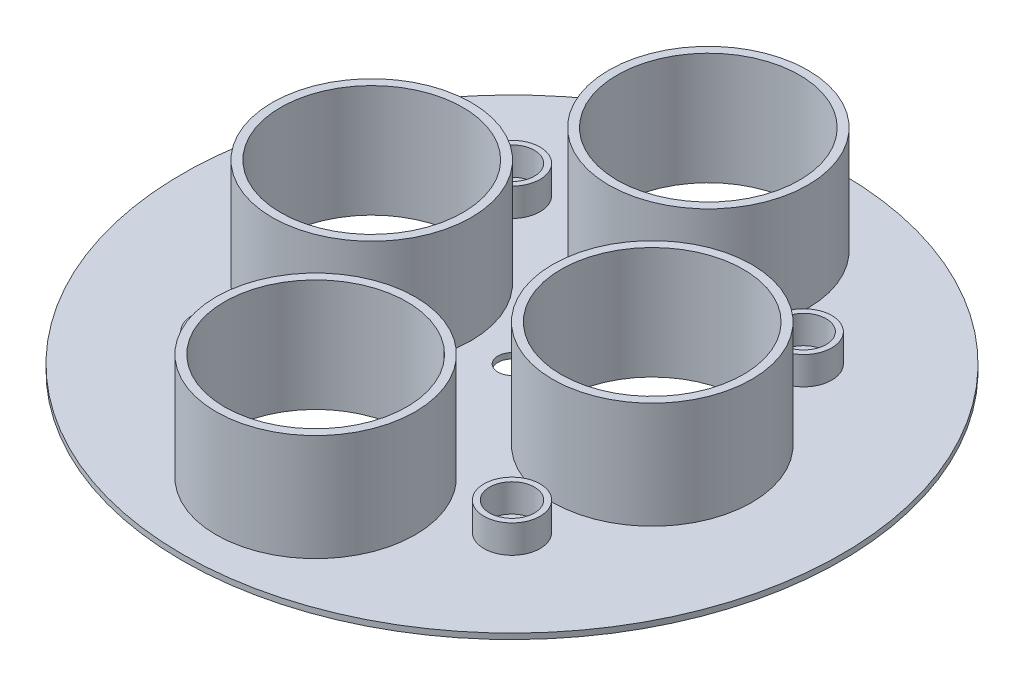
ISO-10303-21;
HEADER;
FILE_DESCRIPTION(('STEP AP214'),'2;1');
FILE_NAME('part.step','',(''),(''),'','','');
FILE_SCHEMA(('AUTOMOTIVE_DESIGN { 1 0 10303 214 1 1 1 1 }'));
ENDSEC;
DATA;
#1=APPLICATION_CONTEXT('core data for automotive mechanical design processes');
#2=APPLICATION_PROTOCOL_DEFINITION('international standard','automotive_design',2000,#1);
#3=PRODUCT_CONTEXT('',#1,'mechanical');
#4=PRODUCT('Part','Part','',(#3));
#5=PRODUCT_RELATED_PRODUCT_CATEGORY('part','',(#4));
#6=PRODUCT_DEFINITION_FORMATION('','',#4);
#7=PRODUCT_DEFINITION_CONTEXT('part definition',#1,'design');
#8=PRODUCT_DEFINITION('design','',#6,#7);
#9=PRODUCT_DEFINITION_SHAPE('','',#8);
#10=(LENGTH_UNIT() NAMED_UNIT(*) SI_UNIT(.MILLI.,.METRE.));
#11=(NAMED_UNIT(*) PLANE_ANGLE_UNIT() SI_UNIT($,.RADIAN.));
#12=(NAMED_UNIT(*) SI_UNIT($,.STERADIAN.) SOLID_ANGLE_UNIT());
#13=UNCERTAINTY_MEASURE_WITH_UNIT(LENGTH_MEASURE(1.E-05),#10,'distance_accuracy_value','');
#14=(GEOMETRIC_REPRESENTATION_CONTEXT(3) GLOBAL_UNCERTAINTY_ASSIGNED_CONTEXT((#13)) GLOBAL_UNIT_ASSIGNED_CONTEXT((#10,
#11,#12)) REPRESENTATION_CONTEXT('',''));
#15=CARTESIAN_POINT('',(0.,0.,0.));
#16=DIRECTION('',(0.,0.,1.));
#17=DIRECTION('',(1.,0.,0.));
#18=AXIS2_PLACEMENT_3D('',#15,#16,#17);
#19=CARTESIAN_POINT('',(0.,2.,0.));
#20=DIRECTION('',(0.,1.,0.));
#21=DIRECTION('',(0.,0.,1.));
#22=AXIS2_PLACEMENT_3D('',#19,#20,#21);
#23=PLANE('',#22);
#24=CARTESIAN_POINT('',(52.,2.,-52.));
#25=DIRECTION('',(0.,1.,0.));
#26=DIRECTION('',(1.,0.,0.));
#27=AXIS2_PLACEMENT_3D('',#24,#25,#26);
#28=CIRCLE('',#27,10.);
#29=CARTESIAN_POINT('',(62.,2.,-52.));
#30=VERTEX_POINT('',#29);
#31=EDGE_CURVE('E210',#30,#30,#28,.T.);
#32=ORIENTED_EDGE('',*,*,#31,.F.);
#33=EDGE_LOOP('',(#32));
#34=FACE_BOUND('',#33,.T.);
#35=CARTESIAN_POINT('',(-52.,2.,-52.));
#36=DIRECTION('',(0.,1.,0.));
#37=DIRECTION('',(1.,0.,0.));
#38=AXIS2_PLACEMENT_3D('',#35,#36,#37);
#39=CIRCLE('',#38,10.);
#40=CARTESIAN_POINT('',(-42.,2.,-52.));
#41=VERTEX_POINT('',#40);
#42=EDGE_CURVE('E201',#41,#41,#39,.T.);
#43=ORIENTED_EDGE('',*,*,#42,.F.);
#44=EDGE_LOOP('',(#43));
#45=FACE_BOUND('',#44,.T.);
#46=CARTESIAN_POINT('',(-52.,2.,52.));
#47=DIRECTION('',(0.,1.,0.));
#48=DIRECTION('',(1.,0.,0.));
#49=AXIS2_PLACEMENT_3D('',#46,#47,#48);
#50=CIRCLE('',#49,10.);
#51=CARTESIAN_POINT('',(-42.,2.,52.));
#52=VERTEX_POINT('',#51);
#53=EDGE_CURVE('E192',#52,#52,#50,.T.);
#54=ORIENTED_EDGE('',*,*,#53,.F.);
#55=EDGE_LOOP('',(#54));
#56=FACE_BOUND('',#55,.T.);
#57=CARTESIAN_POINT('',(52.,2.,52.));
#58=DIRECTION('',(0.,1.,0.));
#59=DIRECTION('',(1.,0.,0.));
#60=AXIS2_PLACEMENT_3D('',#57,#58,#59);
#61=CIRCLE('',#60,10.);
#62=CARTESIAN_POINT('',(62.,2.,52.));
#63=VERTEX_POINT('',#62);
#64=EDGE_CURVE('E183',#63,#63,#61,.T.);
#65=ORIENTED_EDGE('',*,*,#64,.F.);
#66=EDGE_LOOP('',(#65));
#67=FACE_BOUND('',#66,.T.);
#68=CARTESIAN_POINT('',(50.,2.,0.));
#69=DIRECTION('',(0.,1.,0.));
#70=DIRECTION('',(0.,0.,1.));
#71=AXIS2_PLACEMENT_3D('',#68,#69,#70);
#72=CIRCLE('',#71,35.5);
#73=CARTESIAN_POINT('',(50.,2.,35.5));
#74=VERTEX_POINT('',#73);
#75=EDGE_CURVE('E164',#74,#74,#72,.F.);
#76=ORIENTED_EDGE('',*,*,#75,.T.);
#77=EDGE_LOOP('',(#76));
#78=FACE_BOUND('',#77,.T.);
#79=CARTESIAN_POINT('',(0.,2.,70.));
#80=DIRECTION('',(0.,1.,0.));
#81=DIRECTION('',(0.,0.,1.));
#82=AXIS2_PLACEMENT_3D('',#79,#80,#81);
#83=CIRCLE('',#82,35.5);
#84=CARTESIAN_POINT('',(0.,2.,105.5));
#85=VERTEX_POINT('',#84);
#86=EDGE_CURVE('E144',#85,#85,#83,.F.);
#87=ORIENTED_EDGE('',*,*,#86,.T.);
#88=EDGE_LOOP('',(#87));
#89=FACE_BOUND('',#88,.T.);
#90=CARTESIAN_POINT('',(0.,2.,0.));
#91=DIRECTION('',(0.,1.,0.));
#92=DIRECTION('',(0.,0.,1.));
#93=AXIS2_PLACEMENT_3D('',#90,#91,#92);
#94=CIRCLE('',#93,117.5);
#95=CARTESIAN_POINT('',(0.,2.,117.5));
#96=VERTEX_POINT('',#95);
#97=EDGE_CURVE('E122',#96,#96,#94,.T.);
#98=ORIENTED_EDGE('',*,*,#97,.T.);
#99=EDGE_LOOP('',(#98));
#100=FACE_BOUND('',#99,.T.);
#101=CARTESIAN_POINT('',(0.,2.,0.));
#102=DIRECTION('',(0.,1.,0.));
#103=DIRECTION('',(0.,0.,1.));
#104=AXIS2_PLACEMENT_3D('',#101,#102,#103);
#105=CIRCLE('',#104,5.);
#106=CARTESIAN_POINT('',(0.,2.,5.));
#107=VERTEX_POINT('',#106);
#108=EDGE_CURVE('E140',#107,#107,#105,.T.);
#109=ORIENTED_EDGE('',*,*,#108,.F.);
#110=EDGE_LOOP('',(#109));
#111=FACE_BOUND('',#110,.T.);
#112=CARTESIAN_POINT('',(-50.,2.,0.));
#113=DIRECTION('',(0.,1.,0.));
#114=DIRECTION('',(0.,0.,1.));
#115=AXIS2_PLACEMENT_3D('',#112,#113,#114);
#116=CIRCLE('',#115,35.5);
#117=CARTESIAN_POINT('',(-50.,2.,35.5));
#118=VERTEX_POINT('',#117);
#119=EDGE_CURVE('E155',#118,#118,#116,.F.);
#120=ORIENTED_EDGE('',*,*,#119,.T.);
#121=EDGE_LOOP('',(#120));
#122=FACE_BOUND('',#121,.T.);
#123=CARTESIAN_POINT('',(0.,2.,-70.));
#124=DIRECTION('',(0.,1.,0.));
#125=DIRECTION('',(0.,0.,1.));
#126=AXIS2_PLACEMENT_3D('',#123,#124,#125);
#127=CIRCLE('',#126,35.5);
#128=CARTESIAN_POINT('',(0.,2.,-34.5));
#129=VERTEX_POINT('',#128);
#130=EDGE_CURVE('E173',#129,#129,#127,.F.);
#131=ORIENTED_EDGE('',*,*,#130,.T.);
#132=EDGE_LOOP('',(#131));
#133=FACE_BOUND('',#132,.T.);
#134=ADVANCED_FACE('F102',(#34,#45,#56,#67,#78,#89,#100,#111,#122,#133),#23,.T.);
#135=CARTESIAN_POINT('',(0.,0.,0.));
#136=DIRECTION('',(0.,1.,0.));
#137=DIRECTION('',(0.,0.,1.));
#138=AXIS2_PLACEMENT_3D('',#135,#136,#137);
#139=PLANE('',#138);
#140=CARTESIAN_POINT('',(0.,0.,-70.));
#141=DIRECTION('',(0.,1.,0.));
#142=DIRECTION('',(0.,0.,1.));
#143=AXIS2_PLACEMENT_3D('',#140,#141,#142);
#144=CIRCLE('',#143,32.5);
#145=CARTESIAN_POINT('',(0.,0.,-37.5));
#146=VERTEX_POINT('',#145);
#147=EDGE_CURVE('E126',#146,#146,#144,.T.);
#148=ORIENTED_EDGE('',*,*,#147,.T.);
#149=EDGE_LOOP('',(#148));
#150=FACE_BOUND('',#149,.T.);
#151=CARTESIAN_POINT('',(-50.,0.,0.));
#152=DIRECTION('',(0.,1.,0.));
#153=DIRECTION('',(0.,0.,1.));
#154=AXIS2_PLACEMENT_3D('',#151,#152,#153);
#155=CIRCLE('',#154,32.5);
#156=CARTESIAN_POINT('',(-50.,0.,32.5));
#157=VERTEX_POINT('',#156);
#158=EDGE_CURVE('E137',#157,#157,#155,.T.);
#159=ORIENTED_EDGE('',*,*,#158,.T.);
#160=EDGE_LOOP('',(#159));
#161=FACE_BOUND('',#160,.T.);
#162=CARTESIAN_POINT('',(0.,0.,0.));
#163=DIRECTION('',(0.,1.,0.));
#164=DIRECTION('',(0.,0.,1.));
#165=AXIS2_PLACEMENT_3D('',#162,#163,#164);
#166=CIRCLE('',#165,117.5);
#167=CARTESIAN_POINT('',(0.,0.,117.5));
#168=VERTEX_POINT('',#167);
#169=EDGE_CURVE('E123',#168,#168,#166,.T.);
#170=ORIENTED_EDGE('',*,*,#169,.F.);
#171=EDGE_LOOP('',(#170));
#172=FACE_BOUND('',#171,.T.);
#173=CARTESIAN_POINT('',(0.,0.,0.));
#174=DIRECTION('',(0.,1.,0.));
#175=DIRECTION('',(0.,0.,1.));
#176=AXIS2_PLACEMENT_3D('',#173,#174,#175);
#177=CIRCLE('',#176,5.);
#178=CARTESIAN_POINT('',(0.,0.,5.));
#179=VERTEX_POINT('',#178);
#180=EDGE_CURVE('E141',#179,#179,#177,.T.);
#181=ORIENTED_EDGE('',*,*,#180,.T.);
#182=EDGE_LOOP('',(#181));
#183=FACE_BOUND('',#182,.T.);
#184=CARTESIAN_POINT('',(0.,0.,70.));
#185=DIRECTION('',(0.,1.,0.));
#186=DIRECTION('',(0.,0.,1.));
#187=AXIS2_PLACEMENT_3D('',#184,#185,#186);
#188=CIRCLE('',#187,32.5);
#189=CARTESIAN_POINT('',(0.,0.,102.5));
#190=VERTEX_POINT('',#189);
#191=EDGE_CURVE('E134',#190,#190,#188,.T.);
#192=ORIENTED_EDGE('',*,*,#191,.T.);
#193=EDGE_LOOP('',(#192));
#194=FACE_BOUND('',#193,.T.);
#195=CARTESIAN_POINT('',(50.,0.,0.));
#196=DIRECTION('',(0.,1.,0.));
#197=DIRECTION('',(0.,0.,1.));
#198=AXIS2_PLACEMENT_3D('',#195,#196,#197);
#199=CIRCLE('',#198,32.5);
#200=CARTESIAN_POINT('',(50.,0.,32.5));
#201=VERTEX_POINT('',#200);
#202=EDGE_CURVE('E131',#201,#201,#199,.T.);
#203=ORIENTED_EDGE('',*,*,#202,.T.);
#204=EDGE_LOOP('',(#203));
#205=FACE_BOUND('',#204,.T.);
#206=ADVANCED_FACE('F240',(#150,#161,#172,#183,#194,#205),#139,.F.);
#207=CARTESIAN_POINT('',(0.,2.,0.));
#208=DIRECTION('',(0.,-1.,0.));
#209=DIRECTION('',(0.,0.,-1.));
#210=AXIS2_PLACEMENT_3D('',#207,#208,#209);
#211=CYLINDRICAL_SURFACE('',#210,117.5);
#212=ORIENTED_EDGE('',*,*,#97,.F.);
#213=EDGE_LOOP('',(#212));
#214=FACE_BOUND('',#213,.T.);
#215=ORIENTED_EDGE('',*,*,#169,.T.);
#216=EDGE_LOOP('',(#215));
#217=FACE_BOUND('',#216,.T.);
#218=ADVANCED_FACE('F104',(#214,#217),#211,.T.);
#219=CARTESIAN_POINT('',(0.,2.,-70.));
#220=DIRECTION('',(0.,-1.,0.));
#221=DIRECTION('',(0.,0.,-1.));
#222=AXIS2_PLACEMENT_3D('',#219,#220,#221);
#223=CYLINDRICAL_SURFACE('',#222,32.5);
#224=ORIENTED_EDGE('',*,*,#147,.F.);
#225=EDGE_LOOP('',(#224));
#226=FACE_BOUND('',#225,.T.);
#227=CARTESIAN_POINT('',(0.,40.,-70.));
#228=DIRECTION('',(0.,1.,0.));
#229=DIRECTION('',(0.,0.,1.));
#230=AXIS2_PLACEMENT_3D('',#227,#228,#229);
#231=CIRCLE('',#230,32.5);
#232=CARTESIAN_POINT('',(0.,40.,-37.5));
#233=VERTEX_POINT('',#232);
#234=EDGE_CURVE('E179',#233,#233,#231,.T.);
#235=ORIENTED_EDGE('',*,*,#234,.T.);
#236=EDGE_LOOP('',(#235));
#237=FACE_BOUND('',#236,.T.);
#238=ADVANCED_FACE('F342',(#226,#237),#223,.F.);
#239=CARTESIAN_POINT('',(50.,2.,0.));
#240=DIRECTION('',(0.,-1.,0.));
#241=DIRECTION('',(0.,0.,-1.));
#242=AXIS2_PLACEMENT_3D('',#239,#240,#241);
#243=CYLINDRICAL_SURFACE('',#242,32.5);
#244=ORIENTED_EDGE('',*,*,#202,.F.);
#245=EDGE_LOOP('',(#244));
#246=FACE_BOUND('',#245,.T.);
#247=CARTESIAN_POINT('',(50.,40.,0.));
#248=DIRECTION('',(0.,1.,0.));
#249=DIRECTION('',(0.,0.,1.));
#250=AXIS2_PLACEMENT_3D('',#247,#248,#249);
#251=CIRCLE('',#250,32.5);
#252=CARTESIAN_POINT('',(50.,40.,32.5));
#253=VERTEX_POINT('',#252);
#254=EDGE_CURVE('E170',#253,#253,#251,.T.);
#255=ORIENTED_EDGE('',*,*,#254,.T.);
#256=EDGE_LOOP('',(#255));
#257=FACE_BOUND('',#256,.T.);
#258=ADVANCED_FACE('F339',(#246,#257),#243,.F.);
#259=CARTESIAN_POINT('',(0.,2.,70.));
#260=DIRECTION('',(0.,-1.,0.));
#261=DIRECTION('',(0.,0.,-1.));
#262=AXIS2_PLACEMENT_3D('',#259,#260,#261);
#263=CYLINDRICAL_SURFACE('',#262,32.5);
#264=ORIENTED_EDGE('',*,*,#191,.F.);
#265=EDGE_LOOP('',(#264));
#266=FACE_BOUND('',#265,.T.);
#267=CARTESIAN_POINT('',(0.,40.,70.));
#268=DIRECTION('',(0.,1.,0.));
#269=DIRECTION('',(0.,0.,1.));
#270=AXIS2_PLACEMENT_3D('',#267,#268,#269);
#271=CIRCLE('',#270,32.5);
#272=CARTESIAN_POINT('',(0.,40.,102.5));
#273=VERTEX_POINT('',#272);
#274=EDGE_CURVE('E152',#273,#273,#271,.T.);
#275=ORIENTED_EDGE('',*,*,#274,.T.);
#276=EDGE_LOOP('',(#275));
#277=FACE_BOUND('',#276,.T.);
#278=ADVANCED_FACE('F335',(#266,#277),#263,.F.);
#279=CARTESIAN_POINT('',(-50.,2.,0.));
#280=DIRECTION('',(0.,-1.,0.));
#281=DIRECTION('',(0.,0.,-1.));
#282=AXIS2_PLACEMENT_3D('',#279,#280,#281);
#283=CYLINDRICAL_SURFACE('',#282,32.5);
#284=ORIENTED_EDGE('',*,*,#158,.F.);
#285=EDGE_LOOP('',(#284));
#286=FACE_BOUND('',#285,.T.);
#287=CARTESIAN_POINT('',(-50.,40.,0.));
#288=DIRECTION('',(0.,1.,0.));
#289=DIRECTION('',(0.,0.,1.));
#290=AXIS2_PLACEMENT_3D('',#287,#288,#289);
#291=CIRCLE('',#290,32.5);
#292=CARTESIAN_POINT('',(-50.,40.,32.5));
#293=VERTEX_POINT('',#292);
#294=EDGE_CURVE('E161',#293,#293,#291,.T.);
#295=ORIENTED_EDGE('',*,*,#294,.T.);
#296=EDGE_LOOP('',(#295));
#297=FACE_BOUND('',#296,.T.);
#298=ADVANCED_FACE('F331',(#286,#297),#283,.F.);
#299=CARTESIAN_POINT('',(0.,2.,0.));
#300=DIRECTION('',(0.,-1.,0.));
#301=DIRECTION('',(0.,0.,-1.));
#302=AXIS2_PLACEMENT_3D('',#299,#300,#301);
#303=CYLINDRICAL_SURFACE('',#302,5.);
#304=ORIENTED_EDGE('',*,*,#108,.T.);
#305=EDGE_LOOP('',(#304));
#306=FACE_BOUND('',#305,.T.);
#307=ORIENTED_EDGE('',*,*,#180,.F.);
#308=EDGE_LOOP('',(#307));
#309=FACE_BOUND('',#308,.T.);
#310=ADVANCED_FACE('F324',(#306,#309),#303,.F.);
#311=CARTESIAN_POINT('',(0.,40.,70.));
#312=DIRECTION('',(0.,1.,0.));
#313=DIRECTION('',(0.,0.,1.));
#314=AXIS2_PLACEMENT_3D('',#311,#312,#313);
#315=PLANE('',#314);
#316=CARTESIAN_POINT('',(0.,40.,70.));
#317=DIRECTION('',(0.,1.,0.));
#318=DIRECTION('',(1.,0.,0.));
#319=AXIS2_PLACEMENT_3D('',#316,#317,#318);
#320=CIRCLE('',#319,35.5);
#321=CARTESIAN_POINT('',(35.5,40.,70.));
#322=VERTEX_POINT('',#321);
#323=EDGE_CURVE('E149',#322,#322,#320,.T.);
#324=ORIENTED_EDGE('',*,*,#323,.T.);
#325=EDGE_LOOP('',(#324));
#326=FACE_BOUND('',#325,.T.);
#327=ORIENTED_EDGE('',*,*,#274,.F.);
#328=EDGE_LOOP('',(#327));
#329=FACE_BOUND('',#328,.T.);
#330=ADVANCED_FACE('F321',(#326,#329),#315,.T.);
#331=CARTESIAN_POINT('',(0.,40.,70.));
#332=DIRECTION('',(0.,-1.,0.));
#333=DIRECTION('',(0.,0.,-1.));
#334=AXIS2_PLACEMENT_3D('',#331,#332,#333);
#335=CYLINDRICAL_SURFACE('',#334,35.5);
#336=ORIENTED_EDGE('',*,*,#86,.F.);
#337=EDGE_LOOP('',(#336));
#338=FACE_BOUND('',#337,.T.);
#339=ORIENTED_EDGE('',*,*,#323,.F.);
#340=EDGE_LOOP('',(#339));
#341=FACE_BOUND('',#340,.T.);
#342=ADVANCED_FACE('F316',(#338,#341),#335,.T.);
#343=CARTESIAN_POINT('',(-50.,40.,0.));
#344=DIRECTION('',(0.,1.,0.));
#345=DIRECTION('',(0.,0.,1.));
#346=AXIS2_PLACEMENT_3D('',#343,#344,#345);
#347=PLANE('',#346);
#348=CARTESIAN_POINT('',(-50.,40.,0.));
#349=DIRECTION('',(0.,1.,0.));
#350=DIRECTION('',(1.,0.,0.));
#351=AXIS2_PLACEMENT_3D('',#348,#349,#350);
#352=CIRCLE('',#351,35.5);
#353=CARTESIAN_POINT('',(-14.5,40.,0.));
#354=VERTEX_POINT('',#353);
#355=EDGE_CURVE('E158',#354,#354,#352,.T.);
#356=ORIENTED_EDGE('',*,*,#355,.T.);
#357=EDGE_LOOP('',(#356));
#358=FACE_BOUND('',#357,.T.);
#359=ORIENTED_EDGE('',*,*,#294,.F.);
#360=EDGE_LOOP('',(#359));
#361=FACE_BOUND('',#360,.T.);
#362=ADVANCED_FACE('F313',(#358,#361),#347,.T.);
#363=CARTESIAN_POINT('',(-50.,40.,0.));
#364=DIRECTION('',(0.,-1.,0.));
#365=DIRECTION('',(0.,0.,-1.));
#366=AXIS2_PLACEMENT_3D('',#363,#364,#365);
#367=CYLINDRICAL_SURFACE('',#366,35.5);
#368=ORIENTED_EDGE('',*,*,#119,.F.);
#369=EDGE_LOOP('',(#368));
#370=FACE_BOUND('',#369,.T.);
#371=ORIENTED_EDGE('',*,*,#355,.F.);
#372=EDGE_LOOP('',(#371));
#373=FACE_BOUND('',#372,.T.);
#374=ADVANCED_FACE('F308',(#370,#373),#367,.T.);
#375=CARTESIAN_POINT('',(50.,40.,0.));
#376=DIRECTION('',(0.,1.,0.));
#377=DIRECTION('',(0.,0.,1.));
#378=AXIS2_PLACEMENT_3D('',#375,#376,#377);
#379=PLANE('',#378);
#380=CARTESIAN_POINT('',(50.,40.,0.));
#381=DIRECTION('',(0.,1.,0.));
#382=DIRECTION('',(1.,0.,0.));
#383=AXIS2_PLACEMENT_3D('',#380,#381,#382);
#384=CIRCLE('',#383,35.5);
#385=CARTESIAN_POINT('',(85.5,40.,0.));
#386=VERTEX_POINT('',#385);
#387=EDGE_CURVE('E167',#386,#386,#384,.T.);
#388=ORIENTED_EDGE('',*,*,#387,.T.);
#389=EDGE_LOOP('',(#388));
#390=FACE_BOUND('',#389,.T.);
#391=ORIENTED_EDGE('',*,*,#254,.F.);
#392=EDGE_LOOP('',(#391));
#393=FACE_BOUND('',#392,.T.);
#394=ADVANCED_FACE('F305',(#390,#393),#379,.T.);
#395=CARTESIAN_POINT('',(50.,40.,0.));
#396=DIRECTION('',(0.,-1.,0.));
#397=DIRECTION('',(0.,0.,-1.));
#398=AXIS2_PLACEMENT_3D('',#395,#396,#397);
#399=CYLINDRICAL_SURFACE('',#398,35.5);
#400=ORIENTED_EDGE('',*,*,#75,.F.);
#401=EDGE_LOOP('',(#400));
#402=FACE_BOUND('',#401,.T.);
#403=ORIENTED_EDGE('',*,*,#387,.F.);
#404=EDGE_LOOP('',(#403));
#405=FACE_BOUND('',#404,.T.);
#406=ADVANCED_FACE('F300',(#402,#405),#399,.T.);
#407=CARTESIAN_POINT('',(0.,40.,-70.));
#408=DIRECTION('',(0.,1.,0.));
#409=DIRECTION('',(0.,0.,1.));
#410=AXIS2_PLACEMENT_3D('',#407,#408,#409);
#411=PLANE('',#410);
#412=CARTESIAN_POINT('',(0.,40.,-70.));
#413=DIRECTION('',(0.,1.,0.));
#414=DIRECTION('',(1.,0.,0.));
#415=AXIS2_PLACEMENT_3D('',#412,#413,#414);
#416=CIRCLE('',#415,35.5);
#417=CARTESIAN_POINT('',(35.5,40.,-70.));
#418=VERTEX_POINT('',#417);
#419=EDGE_CURVE('E176',#418,#418,#416,.T.);
#420=ORIENTED_EDGE('',*,*,#419,.T.);
#421=EDGE_LOOP('',(#420));
#422=FACE_BOUND('',#421,.T.);
#423=ORIENTED_EDGE('',*,*,#234,.F.);
#424=EDGE_LOOP('',(#423));
#425=FACE_BOUND('',#424,.T.);
#426=ADVANCED_FACE('F297',(#422,#425),#411,.T.);
#427=CARTESIAN_POINT('',(0.,40.,-70.));
#428=DIRECTION('',(0.,-1.,0.));
#429=DIRECTION('',(0.,0.,-1.));
#430=AXIS2_PLACEMENT_3D('',#427,#428,#429);
#431=CYLINDRICAL_SURFACE('',#430,35.5);
#432=ORIENTED_EDGE('',*,*,#130,.F.);
#433=EDGE_LOOP('',(#432));
#434=FACE_BOUND('',#433,.T.);
#435=ORIENTED_EDGE('',*,*,#419,.F.);
#436=EDGE_LOOP('',(#435));
#437=FACE_BOUND('',#436,.T.);
#438=ADVANCED_FACE('F292',(#434,#437),#431,.T.);
#439=CARTESIAN_POINT('',(52.,12.,52.));
#440=DIRECTION('',(0.,1.,0.));
#441=DIRECTION('',(0.,0.,1.));
#442=AXIS2_PLACEMENT_3D('',#439,#440,#441);
#443=PLANE('',#442);
#444=CARTESIAN_POINT('',(52.,12.,52.));
#445=DIRECTION('',(0.,1.,0.));
#446=DIRECTION('',(1.,0.,0.));
#447=AXIS2_PLACEMENT_3D('',#444,#445,#446);
#448=CIRCLE('',#447,10.);
#449=CARTESIAN_POINT('',(62.,12.,52.));
#450=VERTEX_POINT('',#449);
#451=EDGE_CURVE('E182',#450,#450,#448,.T.);
#452=ORIENTED_EDGE('',*,*,#451,.T.);
#453=EDGE_LOOP('',(#452));
#454=FACE_BOUND('',#453,.T.);
#455=CARTESIAN_POINT('',(52.,12.,52.));
#456=DIRECTION('',(0.,1.,0.));
#457=DIRECTION('',(0.,0.,1.));
#458=AXIS2_PLACEMENT_3D('',#455,#456,#457);
#459=CIRCLE('',#458,8.);
#460=CARTESIAN_POINT('',(52.,12.,60.));
#461=VERTEX_POINT('',#460);
#462=EDGE_CURVE('E186',#461,#461,#459,.T.);
#463=ORIENTED_EDGE('',*,*,#462,.F.);
#464=EDGE_LOOP('',(#463));
#465=FACE_BOUND('',#464,.T.);
#466=ADVANCED_FACE('F289',(#454,#465),#443,.T.);
#467=CARTESIAN_POINT('',(52.,12.,52.));
#468=DIRECTION('',(0.,-1.,0.));
#469=DIRECTION('',(0.,0.,-1.));
#470=AXIS2_PLACEMENT_3D('',#467,#468,#469);
#471=CYLINDRICAL_SURFACE('',#470,10.);
#472=ORIENTED_EDGE('',*,*,#451,.F.);
#473=EDGE_LOOP('',(#472));
#474=FACE_BOUND('',#473,.T.);
#475=ORIENTED_EDGE('',*,*,#64,.T.);
#476=EDGE_LOOP('',(#475));
#477=FACE_BOUND('',#476,.T.);
#478=ADVANCED_FACE('F263',(#474,#477),#471,.T.);
#479=CARTESIAN_POINT('',(52.,12.,52.));
#480=DIRECTION('',(0.,-1.,0.));
#481=DIRECTION('',(0.,0.,-1.));
#482=AXIS2_PLACEMENT_3D('',#479,#480,#481);
#483=CYLINDRICAL_SURFACE('',#482,8.);
#484=ORIENTED_EDGE('',*,*,#462,.T.);
#485=EDGE_LOOP('',(#484));
#486=FACE_BOUND('',#485,.T.);
#487=CARTESIAN_POINT('',(52.,2.,52.));
#488=DIRECTION('',(0.,1.,0.));
#489=DIRECTION('',(0.,0.,1.));
#490=AXIS2_PLACEMENT_3D('',#487,#488,#489);
#491=CIRCLE('',#490,8.);
#492=CARTESIAN_POINT('',(52.,2.,60.));
#493=VERTEX_POINT('',#492);
#494=EDGE_CURVE('E117',#493,#493,#491,.F.);
#495=ORIENTED_EDGE('',*,*,#494,.T.);
#496=EDGE_LOOP('',(#495));
#497=FACE_BOUND('',#496,.T.);
#498=ADVANCED_FACE('F254',(#486,#497),#483,.F.);
#499=ORIENTED_EDGE('',*,*,#494,.F.);
#500=EDGE_LOOP('',(#499));
#501=FACE_BOUND('',#500,.T.);
#502=ADVANCED_FACE('F242',(#501),#23,.T.);
#503=CARTESIAN_POINT('',(-52.,12.,52.));
#504=DIRECTION('',(0.,1.,0.));
#505=DIRECTION('',(0.,0.,1.));
#506=AXIS2_PLACEMENT_3D('',#503,#504,#505);
#507=PLANE('',#506);
#508=CARTESIAN_POINT('',(-52.,12.,52.));
#509=DIRECTION('',(0.,1.,0.));
#510=DIRECTION('',(1.,0.,0.));
#511=AXIS2_PLACEMENT_3D('',#508,#509,#510);
#512=CIRCLE('',#511,10.);
#513=CARTESIAN_POINT('',(-42.,12.,52.));
#514=VERTEX_POINT('',#513);
#515=EDGE_CURVE('E191',#514,#514,#512,.T.);
#516=ORIENTED_EDGE('',*,*,#515,.T.);
#517=EDGE_LOOP('',(#516));
#518=FACE_BOUND('',#517,.T.);
#519=CARTESIAN_POINT('',(-52.,12.,52.));
#520=DIRECTION('',(0.,1.,0.));
#521=DIRECTION('',(0.,0.,1.));
#522=AXIS2_PLACEMENT_3D('',#519,#520,#521);
#523=CIRCLE('',#522,8.);
#524=CARTESIAN_POINT('',(-52.,12.,60.));
#525=VERTEX_POINT('',#524);
#526=EDGE_CURVE('E195',#525,#525,#523,.T.);
#527=ORIENTED_EDGE('',*,*,#526,.F.);
#528=EDGE_LOOP('',(#527));
#529=FACE_BOUND('',#528,.T.);
#530=ADVANCED_FACE('F253',(#518,#529),#507,.T.);
#531=CARTESIAN_POINT('',(-52.,12.,52.));
#532=DIRECTION('',(0.,-1.,0.));
#533=DIRECTION('',(0.,0.,-1.));
#534=AXIS2_PLACEMENT_3D('',#531,#532,#533);
#535=CYLINDRICAL_SURFACE('',#534,10.);
#536=ORIENTED_EDGE('',*,*,#515,.F.);
#537=EDGE_LOOP('',(#536));
#538=FACE_BOUND('',#537,.T.);
#539=ORIENTED_EDGE('',*,*,#53,.T.);
#540=EDGE_LOOP('',(#539));
#541=FACE_BOUND('',#540,.T.);
#542=ADVANCED_FACE('F260',(#538,#541),#535,.T.);
#543=CARTESIAN_POINT('',(-52.,12.,52.));
#544=DIRECTION('',(0.,-1.,0.));
#545=DIRECTION('',(0.,0.,-1.));
#546=AXIS2_PLACEMENT_3D('',#543,#544,#545);
#547=CYLINDRICAL_SURFACE('',#546,8.);
#548=ORIENTED_EDGE('',*,*,#526,.T.);
#549=EDGE_LOOP('',(#548));
#550=FACE_BOUND('',#549,.T.);
#551=CARTESIAN_POINT('',(-52.,2.,52.));
#552=DIRECTION('',(0.,1.,0.));
#553=DIRECTION('',(0.,0.,1.));
#554=AXIS2_PLACEMENT_3D('',#551,#552,#553);
#555=CIRCLE('',#554,8.);
#556=CARTESIAN_POINT('',(-52.,2.,60.));
#557=VERTEX_POINT('',#556);
#558=EDGE_CURVE('E113',#557,#557,#555,.F.);
#559=ORIENTED_EDGE('',*,*,#558,.T.);
#560=EDGE_LOOP('',(#559));
#561=FACE_BOUND('',#560,.T.);
#562=ADVANCED_FACE('F269',(#550,#561),#547,.F.);
#563=ORIENTED_EDGE('',*,*,#558,.F.);
#564=EDGE_LOOP('',(#563));
#565=FACE_BOUND('',#564,.T.);
#566=ADVANCED_FACE('F236',(#565),#23,.T.);
#567=CARTESIAN_POINT('',(-52.,12.,-52.));
#568=DIRECTION('',(0.,1.,0.));
#569=DIRECTION('',(0.,0.,1.));
#570=AXIS2_PLACEMENT_3D('',#567,#568,#569);
#571=PLANE('',#570);
#572=CARTESIAN_POINT('',(-52.,12.,-52.));
#573=DIRECTION('',(0.,1.,0.));
#574=DIRECTION('',(1.,0.,0.));
#575=AXIS2_PLACEMENT_3D('',#572,#573,#574);
#576=CIRCLE('',#575,10.);
#577=CARTESIAN_POINT('',(-42.,12.,-52.));
#578=VERTEX_POINT('',#577);
#579=EDGE_CURVE('E200',#578,#578,#576,.T.);
#580=ORIENTED_EDGE('',*,*,#579,.T.);
#581=EDGE_LOOP('',(#580));
#582=FACE_BOUND('',#581,.T.);
#583=CARTESIAN_POINT('',(-52.,12.,-52.));
#584=DIRECTION('',(0.,1.,0.));
#585=DIRECTION('',(0.,0.,1.));
#586=AXIS2_PLACEMENT_3D('',#583,#584,#585);
#587=CIRCLE('',#586,8.);
#588=CARTESIAN_POINT('',(-52.,12.,-44.));
#589=VERTEX_POINT('',#588);
#590=EDGE_CURVE('E204',#589,#589,#587,.T.);
#591=ORIENTED_EDGE('',*,*,#590,.F.);
#592=EDGE_LOOP('',(#591));
#593=FACE_BOUND('',#592,.T.);
#594=ADVANCED_FACE('F268',(#582,#593),#571,.T.);
#595=CARTESIAN_POINT('',(-52.,12.,-52.));
#596=DIRECTION('',(0.,-1.,0.));
#597=DIRECTION('',(0.,0.,-1.));
#598=AXIS2_PLACEMENT_3D('',#595,#596,#597);
#599=CYLINDRICAL_SURFACE('',#598,10.);
#600=ORIENTED_EDGE('',*,*,#579,.F.);
#601=EDGE_LOOP('',(#600));
#602=FACE_BOUND('',#601,.T.);
#603=ORIENTED_EDGE('',*,*,#42,.T.);
#604=EDGE_LOOP('',(#603));
#605=FACE_BOUND('',#604,.T.);
#606=ADVANCED_FACE('F275',(#602,#605),#599,.T.);
#607=CARTESIAN_POINT('',(-52.,12.,-52.));
#608=DIRECTION('',(0.,-1.,0.));
#609=DIRECTION('',(0.,0.,-1.));
#610=AXIS2_PLACEMENT_3D('',#607,#608,#609);
#611=CYLINDRICAL_SURFACE('',#610,8.);
#612=ORIENTED_EDGE('',*,*,#590,.T.);
#613=EDGE_LOOP('',(#612));
#614=FACE_BOUND('',#613,.T.);
#615=CARTESIAN_POINT('',(-52.,2.,-52.));
#616=DIRECTION('',(0.,1.,0.));
#617=DIRECTION('',(0.,0.,1.));
#618=AXIS2_PLACEMENT_3D('',#615,#616,#617);
#619=CIRCLE('',#618,8.);
#620=CARTESIAN_POINT('',(-52.,2.,-44.));
#621=VERTEX_POINT('',#620);
#622=EDGE_CURVE('E109',#621,#621,#619,.F.);
#623=ORIENTED_EDGE('',*,*,#622,.T.);
#624=EDGE_LOOP('',(#623));
#625=FACE_BOUND('',#624,.T.);
#626=ADVANCED_FACE('F233',(#614,#625),#611,.F.);
#627=ORIENTED_EDGE('',*,*,#622,.F.);
#628=EDGE_LOOP('',(#627));
#629=FACE_BOUND('',#628,.T.);
#630=ADVANCED_FACE('F224',(#629),#23,.T.);
#631=CARTESIAN_POINT('',(52.,12.,-52.));
#632=DIRECTION('',(0.,1.,0.));
#633=DIRECTION('',(0.,0.,1.));
#634=AXIS2_PLACEMENT_3D('',#631,#632,#633);
#635=PLANE('',#634);
#636=CARTESIAN_POINT('',(52.,12.,-52.));
#637=DIRECTION('',(0.,1.,0.));
#638=DIRECTION('',(1.,0.,0.));
#639=AXIS2_PLACEMENT_3D('',#636,#637,#638);
#640=CIRCLE('',#639,10.);
#641=CARTESIAN_POINT('',(62.,12.,-52.));
#642=VERTEX_POINT('',#641);
#643=EDGE_CURVE('E209',#642,#642,#640,.T.);
#644=ORIENTED_EDGE('',*,*,#643,.T.);
#645=EDGE_LOOP('',(#644));
#646=FACE_BOUND('',#645,.T.);
#647=CARTESIAN_POINT('',(52.,12.,-52.));
#648=DIRECTION('',(0.,1.,0.));
#649=DIRECTION('',(0.,0.,1.));
#650=AXIS2_PLACEMENT_3D('',#647,#648,#649);
#651=CIRCLE('',#650,8.00000000000001);
#652=CARTESIAN_POINT('',(52.,12.,-44.));
#653=VERTEX_POINT('',#652);
#654=EDGE_CURVE('E213',#653,#653,#651,.T.);
#655=ORIENTED_EDGE('',*,*,#654,.F.);
#656=EDGE_LOOP('',(#655));
#657=FACE_BOUND('',#656,.T.);
#658=ADVANCED_FACE('F221',(#646,#657),#635,.T.);
#659=CARTESIAN_POINT('',(52.,12.,-52.));
#660=DIRECTION('',(0.,-1.,0.));
#661=DIRECTION('',(0.,0.,-1.));
#662=AXIS2_PLACEMENT_3D('',#659,#660,#661);
#663=CYLINDRICAL_SURFACE('',#662,10.);
#664=ORIENTED_EDGE('',*,*,#643,.F.);
#665=EDGE_LOOP('',(#664));
#666=FACE_BOUND('',#665,.T.);
#667=ORIENTED_EDGE('',*,*,#31,.T.);
#668=EDGE_LOOP('',(#667));
#669=FACE_BOUND('',#668,.T.);
#670=ADVANCED_FACE('F223',(#666,#669),#663,.T.);
#671=CARTESIAN_POINT('',(52.,12.,-52.));
#672=DIRECTION('',(0.,-1.,0.));
#673=DIRECTION('',(0.,0.,-1.));
#674=AXIS2_PLACEMENT_3D('',#671,#672,#673);
#675=CYLINDRICAL_SURFACE('',#674,8.00000000000001);
#676=ORIENTED_EDGE('',*,*,#654,.T.);
#677=EDGE_LOOP('',(#676));
#678=FACE_BOUND('',#677,.T.);
#679=CARTESIAN_POINT('',(52.,2.,-52.));
#680=DIRECTION('',(0.,1.,0.));
#681=DIRECTION('',(0.,0.,1.));
#682=AXIS2_PLACEMENT_3D('',#679,#680,#681);
#683=CIRCLE('',#682,8.00000000000001);
#684=CARTESIAN_POINT('',(52.,2.,-44.));
#685=VERTEX_POINT('',#684);
#686=EDGE_CURVE('E11',#685,#685,#683,.F.);
#687=ORIENTED_EDGE('',*,*,#686,.T.);
#688=EDGE_LOOP('',(#687));
#689=FACE_BOUND('',#688,.T.);
#690=ADVANCED_FACE('F219',(#678,#689),#675,.F.);
#691=ORIENTED_EDGE('',*,*,#686,.F.);
#692=EDGE_LOOP('',(#691));
#693=FACE_BOUND('',#692,.T.);
#694=ADVANCED_FACE('F237',(#693),#23,.T.);
#695=CLOSED_SHELL('',(#134,#206,#218,#238,#258,#278,#298,#310,#330,#342,#362,#374,#394,#406,
#426,#438,#466,#478,#498,#502,#530,#542,#562,#566,#594,#606,#626,#630,#658,#670,#690,#694));
#696=MANIFOLD_SOLID_BREP('B2',#695);
#697=ADVANCED_BREP_SHAPE_REPRESENTATION('',(#18,#696),#14);
#698=SHAPE_DEFINITION_REPRESENTATION(#9,#697);
ENDSEC;
END-ISO-10303-21;
